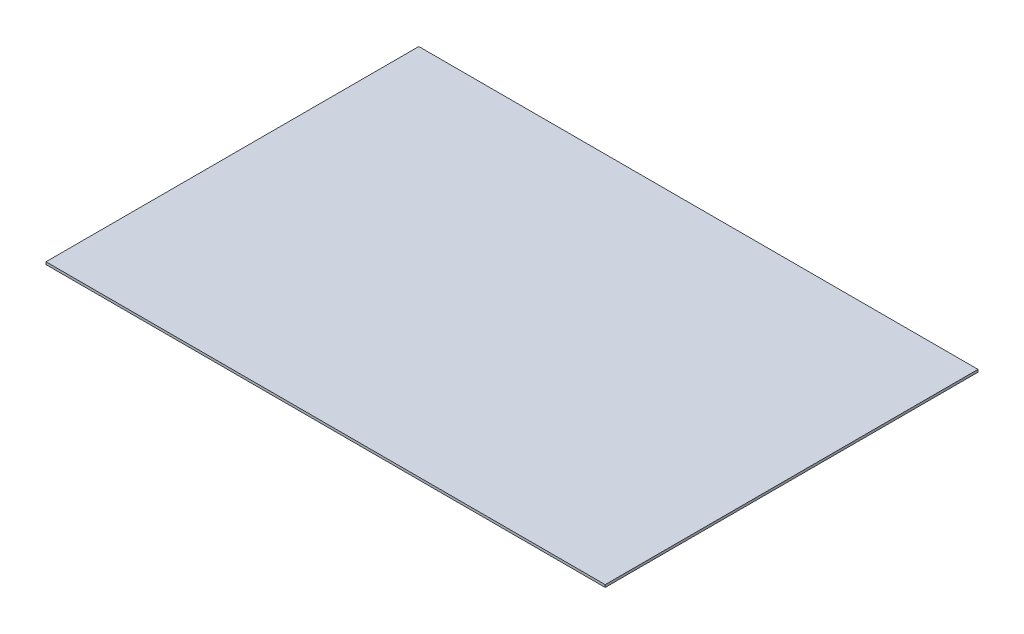
ISO-10303-21;
HEADER;
FILE_DESCRIPTION(('STEP AP214'),'2;1');
FILE_NAME('part.step','',(''),(''),'','','');
FILE_SCHEMA(('AUTOMOTIVE_DESIGN { 1 0 10303 214 1 1 1 1 }'));
ENDSEC;
DATA;
#1=APPLICATION_CONTEXT('core data for automotive mechanical design processes');
#2=APPLICATION_PROTOCOL_DEFINITION('international standard','automotive_design',2000,#1);
#3=PRODUCT_CONTEXT('',#1,'mechanical');
#4=PRODUCT('Part','Part','',(#3));
#5=PRODUCT_RELATED_PRODUCT_CATEGORY('part','',(#4));
#6=PRODUCT_DEFINITION_FORMATION('','',#4);
#7=PRODUCT_DEFINITION_CONTEXT('part definition',#1,'design');
#8=PRODUCT_DEFINITION('design','',#6,#7);
#9=PRODUCT_DEFINITION_SHAPE('','',#8);
#10=(LENGTH_UNIT() NAMED_UNIT(*) SI_UNIT(.MILLI.,.METRE.));
#11=(NAMED_UNIT(*) PLANE_ANGLE_UNIT() SI_UNIT($,.RADIAN.));
#12=(NAMED_UNIT(*) SI_UNIT($,.STERADIAN.) SOLID_ANGLE_UNIT());
#13=UNCERTAINTY_MEASURE_WITH_UNIT(LENGTH_MEASURE(1.E-05),#10,'distance_accuracy_value','');
#14=(GEOMETRIC_REPRESENTATION_CONTEXT(3) GLOBAL_UNCERTAINTY_ASSIGNED_CONTEXT((#13)) GLOBAL_UNIT_ASSIGNED_CONTEXT((#10,
#11,#12)) REPRESENTATION_CONTEXT('',''));
#15=CARTESIAN_POINT('',(0.,0.,0.));
#16=DIRECTION('',(0.,0.,1.));
#17=DIRECTION('',(1.,0.,0.));
#18=AXIS2_PLACEMENT_3D('',#15,#16,#17);
#19=CARTESIAN_POINT('',(-114.3,1.016,-76.2));
#20=DIRECTION('',(1.,0.,0.));
#21=DIRECTION('',(0.,0.,-1.));
#22=AXIS2_PLACEMENT_3D('',#19,#20,#21);
#23=PLANE('',#22);
#24=DIRECTION('',(0.,0.,1.));
#25=VECTOR('',#24,1.);
#26=CARTESIAN_POINT('',(-114.3,0.,-76.2));
#27=LINE('',#26,#25);
#28=CARTESIAN_POINT('',(-114.3,0.,-76.2));
#29=VERTEX_POINT('',#28);
#30=CARTESIAN_POINT('',(-114.3,0.,76.2));
#31=VERTEX_POINT('',#30);
#32=EDGE_CURVE('E96',#29,#31,#27,.T.);
#33=ORIENTED_EDGE('',*,*,#32,.T.);
#34=DIRECTION('',(0.,-1.,0.));
#35=VECTOR('',#34,1.);
#36=CARTESIAN_POINT('',(-114.3,1.016,76.2));
#37=LINE('',#36,#35);
#38=CARTESIAN_POINT('',(-114.3,1.016,76.2));
#39=VERTEX_POINT('',#38);
#40=EDGE_CURVE('E11',#39,#31,#37,.T.);
#41=ORIENTED_EDGE('',*,*,#40,.F.);
#42=DIRECTION('',(0.,0.,1.));
#43=VECTOR('',#42,1.);
#44=CARTESIAN_POINT('',(-114.3,1.016,-76.2));
#45=LINE('',#44,#43);
#46=CARTESIAN_POINT('',(-114.3,1.016,-76.2));
#47=VERTEX_POINT('',#46);
#48=EDGE_CURVE('E84',#47,#39,#45,.T.);
#49=ORIENTED_EDGE('',*,*,#48,.F.);
#50=DIRECTION('',(0.,-1.,0.));
#51=VECTOR('',#50,1.);
#52=CARTESIAN_POINT('',(-114.3,1.016,-76.2));
#53=LINE('',#52,#51);
#54=EDGE_CURVE('E92',#47,#29,#53,.T.);
#55=ORIENTED_EDGE('',*,*,#54,.T.);
#56=EDGE_LOOP('',(#33,#41,#49,#55));
#57=FACE_BOUND('',#56,.T.);
#58=ADVANCED_FACE('F33',(#57),#23,.F.);
#59=CARTESIAN_POINT('',(114.3,1.016,76.2));
#60=DIRECTION('',(0.,0.,-1.));
#61=DIRECTION('',(-1.,0.,0.));
#62=AXIS2_PLACEMENT_3D('',#59,#60,#61);
#63=PLANE('',#62);
#64=DIRECTION('',(1.,0.,0.));
#65=VECTOR('',#64,1.);
#66=CARTESIAN_POINT('',(114.3,0.,76.2));
#67=LINE('',#66,#65);
#68=CARTESIAN_POINT('',(114.3,0.,76.2));
#69=VERTEX_POINT('',#68);
#70=EDGE_CURVE('E88',#31,#69,#67,.T.);
#71=ORIENTED_EDGE('',*,*,#70,.T.);
#72=DIRECTION('',(0.,-1.,0.));
#73=VECTOR('',#72,1.);
#74=CARTESIAN_POINT('',(114.3,1.016,76.2));
#75=LINE('',#74,#73);
#76=CARTESIAN_POINT('',(114.3,1.016,76.2));
#77=VERTEX_POINT('',#76);
#78=EDGE_CURVE('E41',#77,#69,#75,.T.);
#79=ORIENTED_EDGE('',*,*,#78,.F.);
#80=DIRECTION('',(1.,0.,0.));
#81=VECTOR('',#80,1.);
#82=CARTESIAN_POINT('',(114.3,1.016,76.2));
#83=LINE('',#82,#81);
#84=EDGE_CURVE('E79',#39,#77,#83,.T.);
#85=ORIENTED_EDGE('',*,*,#84,.F.);
#86=ORIENTED_EDGE('',*,*,#40,.T.);
#87=EDGE_LOOP('',(#71,#79,#85,#86));
#88=FACE_BOUND('',#87,.T.);
#89=ADVANCED_FACE('F87',(#88),#63,.F.);
#90=CARTESIAN_POINT('',(114.3,1.016,-76.2));
#91=DIRECTION('',(-1.,0.,0.));
#92=DIRECTION('',(0.,0.,1.));
#93=AXIS2_PLACEMENT_3D('',#90,#91,#92);
#94=PLANE('',#93);
#95=DIRECTION('',(0.,0.,-1.));
#96=VECTOR('',#95,1.);
#97=CARTESIAN_POINT('',(114.3,0.,-76.2));
#98=LINE('',#97,#96);
#99=CARTESIAN_POINT('',(114.3,0.,-76.2));
#100=VERTEX_POINT('',#99);
#101=EDGE_CURVE('E66',#69,#100,#98,.T.);
#102=ORIENTED_EDGE('',*,*,#101,.T.);
#103=DIRECTION('',(0.,-1.,0.));
#104=VECTOR('',#103,1.);
#105=CARTESIAN_POINT('',(114.3,1.016,-76.2));
#106=LINE('',#105,#104);
#107=CARTESIAN_POINT('',(114.3,1.016,-76.2));
#108=VERTEX_POINT('',#107);
#109=EDGE_CURVE('E89',#108,#100,#106,.T.);
#110=ORIENTED_EDGE('',*,*,#109,.F.);
#111=DIRECTION('',(0.,0.,-1.));
#112=VECTOR('',#111,1.);
#113=CARTESIAN_POINT('',(114.3,1.016,-76.2));
#114=LINE('',#113,#112);
#115=EDGE_CURVE('E82',#77,#108,#114,.T.);
#116=ORIENTED_EDGE('',*,*,#115,.F.);
#117=ORIENTED_EDGE('',*,*,#78,.T.);
#118=EDGE_LOOP('',(#102,#110,#116,#117));
#119=FACE_BOUND('',#118,.T.);
#120=ADVANCED_FACE('F90',(#119),#94,.F.);
#121=CARTESIAN_POINT('',(114.3,1.016,-76.2));
#122=DIRECTION('',(0.,0.,1.));
#123=DIRECTION('',(1.,0.,0.));
#124=AXIS2_PLACEMENT_3D('',#121,#122,#123);
#125=PLANE('',#124);
#126=DIRECTION('',(-1.,0.,0.));
#127=VECTOR('',#126,1.);
#128=CARTESIAN_POINT('',(114.3,0.,-76.2));
#129=LINE('',#128,#127);
#130=EDGE_CURVE('E72',#100,#29,#129,.T.);
#131=ORIENTED_EDGE('',*,*,#130,.T.);
#132=ORIENTED_EDGE('',*,*,#54,.F.);
#133=DIRECTION('',(-1.,0.,0.));
#134=VECTOR('',#133,1.);
#135=CARTESIAN_POINT('',(114.3,1.016,-76.2));
#136=LINE('',#135,#134);
#137=EDGE_CURVE('E49',#108,#47,#136,.T.);
#138=ORIENTED_EDGE('',*,*,#137,.F.);
#139=ORIENTED_EDGE('',*,*,#109,.T.);
#140=EDGE_LOOP('',(#131,#132,#138,#139));
#141=FACE_BOUND('',#140,.T.);
#142=ADVANCED_FACE('F103',(#141),#125,.F.);
#143=CARTESIAN_POINT('',(-114.3,1.016,76.2));
#144=DIRECTION('',(0.,-1.,0.));
#145=DIRECTION('',(0.,0.,-1.));
#146=AXIS2_PLACEMENT_3D('',#143,#144,#145);
#147=PLANE('',#146);
#148=ORIENTED_EDGE('',*,*,#48,.T.);
#149=ORIENTED_EDGE('',*,*,#84,.T.);
#150=ORIENTED_EDGE('',*,*,#115,.T.);
#151=ORIENTED_EDGE('',*,*,#137,.T.);
#152=EDGE_LOOP('',(#148,#149,#150,#151));
#153=FACE_BOUND('',#152,.T.);
#154=ADVANCED_FACE('F80',(#153),#147,.F.);
#155=CARTESIAN_POINT('',(-114.3,0.,76.2));
#156=DIRECTION('',(0.,-1.,0.));
#157=DIRECTION('',(0.,0.,-1.));
#158=AXIS2_PLACEMENT_3D('',#155,#156,#157);
#159=PLANE('',#158);
#160=ORIENTED_EDGE('',*,*,#32,.F.);
#161=ORIENTED_EDGE('',*,*,#130,.F.);
#162=ORIENTED_EDGE('',*,*,#101,.F.);
#163=ORIENTED_EDGE('',*,*,#70,.F.);
#164=EDGE_LOOP('',(#160,#161,#162,#163));
#165=FACE_BOUND('',#164,.T.);
#166=ADVANCED_FACE('F106',(#165),#159,.T.);
#167=CLOSED_SHELL('',(#58,#89,#120,#142,#154,#166));
#168=MANIFOLD_SOLID_BREP('B2',#167);
#169=ADVANCED_BREP_SHAPE_REPRESENTATION('',(#18,#168),#14);
#170=SHAPE_DEFINITION_REPRESENTATION(#9,#169);
ENDSEC;
END-ISO-10303-21;
